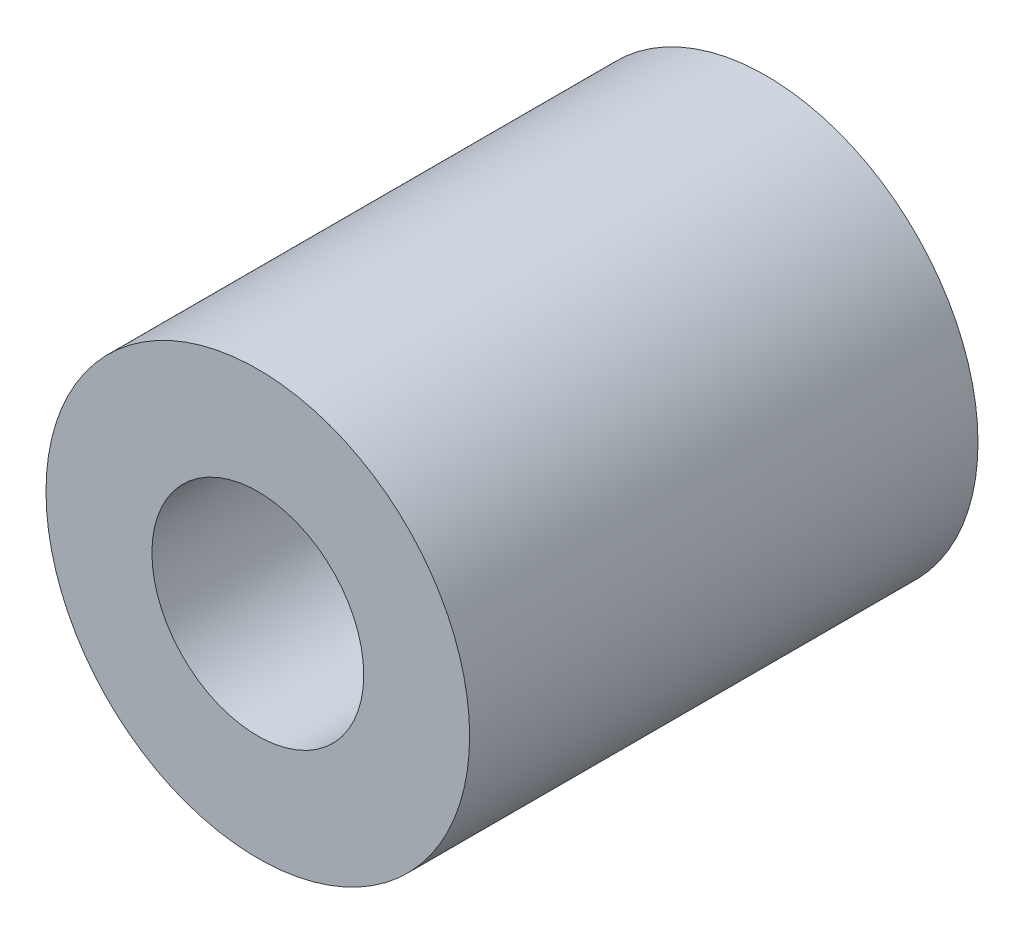
ISO-10303-21;
HEADER;
FILE_DESCRIPTION(('STEP AP214'),'2;1');
FILE_NAME('part.step','',(''),(''),'','','');
FILE_SCHEMA(('AUTOMOTIVE_DESIGN { 1 0 10303 214 1 1 1 1 }'));
ENDSEC;
DATA;
#1=APPLICATION_CONTEXT('core data for automotive mechanical design processes');
#2=APPLICATION_PROTOCOL_DEFINITION('international standard','automotive_design',2000,#1);
#3=PRODUCT_CONTEXT('',#1,'mechanical');
#4=PRODUCT('Part','Part','',(#3));
#5=PRODUCT_RELATED_PRODUCT_CATEGORY('part','',(#4));
#6=PRODUCT_DEFINITION_FORMATION('','',#4);
#7=PRODUCT_DEFINITION_CONTEXT('part definition',#1,'design');
#8=PRODUCT_DEFINITION('design','',#6,#7);
#9=PRODUCT_DEFINITION_SHAPE('','',#8);
#10=(LENGTH_UNIT() NAMED_UNIT(*) SI_UNIT(.MILLI.,.METRE.));
#11=(NAMED_UNIT(*) PLANE_ANGLE_UNIT() SI_UNIT($,.RADIAN.));
#12=(NAMED_UNIT(*) SI_UNIT($,.STERADIAN.) SOLID_ANGLE_UNIT());
#13=UNCERTAINTY_MEASURE_WITH_UNIT(LENGTH_MEASURE(1.E-05),#10,'distance_accuracy_value','');
#14=(GEOMETRIC_REPRESENTATION_CONTEXT(3) GLOBAL_UNCERTAINTY_ASSIGNED_CONTEXT((#13)) GLOBAL_UNIT_ASSIGNED_CONTEXT((#10,
#11,#12)) REPRESENTATION_CONTEXT('',''));
#15=CARTESIAN_POINT('',(0.,0.,0.));
#16=DIRECTION('',(0.,0.,1.));
#17=DIRECTION('',(1.,0.,0.));
#18=AXIS2_PLACEMENT_3D('',#15,#16,#17);
#19=CARTESIAN_POINT('',(0.,0.,12.));
#20=DIRECTION('',(0.,0.,-1.));
#21=DIRECTION('',(-1.,0.,0.));
#22=AXIS2_PLACEMENT_3D('',#19,#20,#21);
#23=CYLINDRICAL_SURFACE('',#22,5.);
#24=CARTESIAN_POINT('',(0.,0.,12.));
#25=DIRECTION('',(0.,0.,1.));
#26=DIRECTION('',(1.,0.,0.));
#27=AXIS2_PLACEMENT_3D('',#24,#25,#26);
#28=CIRCLE('',#27,5.);
#29=CARTESIAN_POINT('',(5.,0.,12.));
#30=VERTEX_POINT('',#29);
#31=EDGE_CURVE('E10',#30,#30,#28,.T.);
#32=ORIENTED_EDGE('',*,*,#31,.F.);
#33=EDGE_LOOP('',(#32));
#34=FACE_BOUND('',#33,.T.);
#35=CARTESIAN_POINT('',(0.,0.,0.));
#36=DIRECTION('',(0.,0.,1.));
#37=DIRECTION('',(1.,0.,0.));
#38=AXIS2_PLACEMENT_3D('',#35,#36,#37);
#39=CIRCLE('',#38,5.);
#40=CARTESIAN_POINT('',(5.,0.,0.));
#41=VERTEX_POINT('',#40);
#42=EDGE_CURVE('E36',#41,#41,#39,.T.);
#43=ORIENTED_EDGE('',*,*,#42,.T.);
#44=EDGE_LOOP('',(#43));
#45=FACE_BOUND('',#44,.T.);
#46=ADVANCED_FACE('F33',(#34,#45),#23,.T.);
#47=CARTESIAN_POINT('',(0.,0.,12.));
#48=DIRECTION('',(0.,0.,1.));
#49=DIRECTION('',(1.,0.,0.));
#50=AXIS2_PLACEMENT_3D('',#47,#48,#49);
#51=PLANE('',#50);
#52=CARTESIAN_POINT('',(0.,0.,12.));
#53=DIRECTION('',(0.,0.,1.));
#54=DIRECTION('',(1.,0.,0.));
#55=AXIS2_PLACEMENT_3D('',#52,#53,#54);
#56=CIRCLE('',#55,2.5);
#57=CARTESIAN_POINT('',(2.5,0.,12.));
#58=VERTEX_POINT('',#57);
#59=EDGE_CURVE('E47',#58,#58,#56,.T.);
#60=ORIENTED_EDGE('',*,*,#59,.F.);
#61=EDGE_LOOP('',(#60));
#62=FACE_BOUND('',#61,.T.);
#63=ORIENTED_EDGE('',*,*,#31,.T.);
#64=EDGE_LOOP('',(#63));
#65=FACE_BOUND('',#64,.T.);
#66=ADVANCED_FACE('F53',(#62,#65),#51,.T.);
#67=CARTESIAN_POINT('',(0.,0.,0.));
#68=DIRECTION('',(0.,0.,1.));
#69=DIRECTION('',(1.,0.,0.));
#70=AXIS2_PLACEMENT_3D('',#67,#68,#69);
#71=PLANE('',#70);
#72=CARTESIAN_POINT('',(0.,0.,0.));
#73=DIRECTION('',(0.,0.,1.));
#74=DIRECTION('',(1.,0.,0.));
#75=AXIS2_PLACEMENT_3D('',#72,#73,#74);
#76=CIRCLE('',#75,2.5);
#77=CARTESIAN_POINT('',(2.5,0.,0.));
#78=VERTEX_POINT('',#77);
#79=EDGE_CURVE('E43',#78,#78,#76,.T.);
#80=ORIENTED_EDGE('',*,*,#79,.T.);
#81=EDGE_LOOP('',(#80));
#82=FACE_BOUND('',#81,.T.);
#83=ORIENTED_EDGE('',*,*,#42,.F.);
#84=EDGE_LOOP('',(#83));
#85=FACE_BOUND('',#84,.T.);
#86=ADVANCED_FACE('F55',(#82,#85),#71,.F.);
#87=CARTESIAN_POINT('',(0.,0.,12.));
#88=DIRECTION('',(0.,0.,1.));
#89=DIRECTION('',(1.,0.,0.));
#90=AXIS2_PLACEMENT_3D('',#87,#88,#89);
#91=CYLINDRICAL_SURFACE('',#90,2.5);
#92=ORIENTED_EDGE('',*,*,#79,.F.);
#93=EDGE_LOOP('',(#92));
#94=FACE_BOUND('',#93,.T.);
#95=ORIENTED_EDGE('',*,*,#59,.T.);
#96=EDGE_LOOP('',(#95));
#97=FACE_BOUND('',#96,.T.);
#98=ADVANCED_FACE('F51',(#94,#97),#91,.F.);
#99=CLOSED_SHELL('',(#46,#66,#86,#98));
#100=MANIFOLD_SOLID_BREP('B2',#99);
#101=ADVANCED_BREP_SHAPE_REPRESENTATION('',(#18,#100),#14);
#102=SHAPE_DEFINITION_REPRESENTATION(#9,#101);
ENDSEC;
END-ISO-10303-21;
